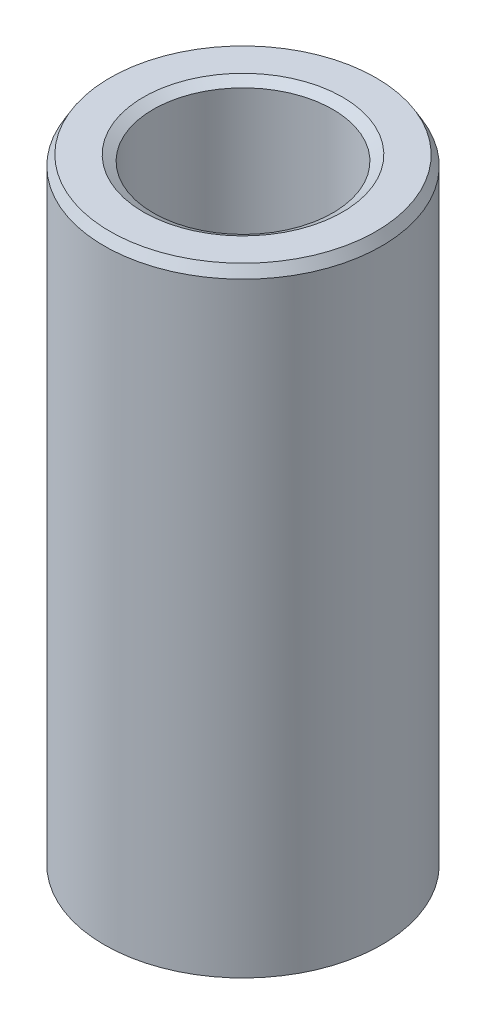
ISO-10303-21;
HEADER;
FILE_DESCRIPTION(('STEP AP214'),'2;1');
FILE_NAME('part.step','',(''),(''),'','','');
FILE_SCHEMA(('AUTOMOTIVE_DESIGN { 1 0 10303 214 1 1 1 1 }'));
ENDSEC;
DATA;
#1=APPLICATION_CONTEXT('core data for automotive mechanical design processes');
#2=APPLICATION_PROTOCOL_DEFINITION('international standard','automotive_design',2000,#1);
#3=PRODUCT_CONTEXT('',#1,'mechanical');
#4=PRODUCT('Part','Part','',(#3));
#5=PRODUCT_RELATED_PRODUCT_CATEGORY('part','',(#4));
#6=PRODUCT_DEFINITION_FORMATION('','',#4);
#7=PRODUCT_DEFINITION_CONTEXT('part definition',#1,'design');
#8=PRODUCT_DEFINITION('design','',#6,#7);
#9=PRODUCT_DEFINITION_SHAPE('','',#8);
#10=(LENGTH_UNIT() NAMED_UNIT(*) SI_UNIT(.MILLI.,.METRE.));
#11=(NAMED_UNIT(*) PLANE_ANGLE_UNIT() SI_UNIT($,.RADIAN.));
#12=(NAMED_UNIT(*) SI_UNIT($,.STERADIAN.) SOLID_ANGLE_UNIT());
#13=UNCERTAINTY_MEASURE_WITH_UNIT(LENGTH_MEASURE(1.E-05),#10,'distance_accuracy_value','');
#14=(GEOMETRIC_REPRESENTATION_CONTEXT(3) GLOBAL_UNCERTAINTY_ASSIGNED_CONTEXT((#13)) GLOBAL_UNIT_ASSIGNED_CONTEXT((#10,
#11,#12)) REPRESENTATION_CONTEXT('',''));
#15=CARTESIAN_POINT('',(0.,0.,0.));
#16=DIRECTION('',(0.,0.,1.));
#17=DIRECTION('',(1.,0.,0.));
#18=AXIS2_PLACEMENT_3D('',#15,#16,#17);
#19=CARTESIAN_POINT('',(0.,44.7324756518549,0.));
#20=DIRECTION('',(0.,-1.,0.));
#21=DIRECTION('',(0.,0.,-1.));
#22=AXIS2_PLACEMENT_3D('',#19,#20,#21);
#23=CYLINDRICAL_SURFACE('',#22,10.);
#24=CARTESIAN_POINT('',(0.,0.408844589447899,0.));
#25=DIRECTION('',(0.,1.,0.));
#26=DIRECTION('',(0.,0.,1.));
#27=AXIS2_PLACEMENT_3D('',#24,#25,#26);
#28=CIRCLE('',#27,10.);
#29=CARTESIAN_POINT('',(0.,0.408844589447899,10.));
#30=VERTEX_POINT('',#29);
#31=EDGE_CURVE('E10',#30,#30,#28,.T.);
#32=ORIENTED_EDGE('',*,*,#31,.T.);
#33=EDGE_LOOP('',(#32));
#34=FACE_BOUND('',#33,.T.);
#35=CARTESIAN_POINT('',(0.,44.0243360505315,0.));
#36=DIRECTION('',(0.,1.,0.));
#37=DIRECTION('',(0.,0.,1.));
#38=AXIS2_PLACEMENT_3D('',#35,#36,#37);
#39=CIRCLE('',#38,10.);
#40=CARTESIAN_POINT('',(0.,44.0243360505315,-10.));
#41=VERTEX_POINT('',#40);
#42=EDGE_CURVE('E50',#41,#41,#39,.F.);
#43=ORIENTED_EDGE('',*,*,#42,.T.);
#44=EDGE_LOOP('',(#43));
#45=FACE_BOUND('',#44,.T.);
#46=ADVANCED_FACE('F39',(#34,#45),#23,.T.);
#47=CARTESIAN_POINT('',(0.,44.7324756518549,0.));
#48=DIRECTION('',(0.,1.,0.));
#49=DIRECTION('',(0.,0.,1.));
#50=AXIS2_PLACEMENT_3D('',#47,#48,#49);
#51=PLANE('',#50);
#52=CARTESIAN_POINT('',(0.,44.7324756518549,0.));
#53=DIRECTION('',(0.,1.,0.));
#54=DIRECTION('',(0.,0.,1.));
#55=AXIS2_PLACEMENT_3D('',#52,#53,#54);
#56=CIRCLE('',#55,7.17815464745107);
#57=CARTESIAN_POINT('',(0.,44.7324756518549,7.17815464745107));
#58=VERTEX_POINT('',#57);
#59=EDGE_CURVE('E58',#58,#58,#56,.F.);
#60=ORIENTED_EDGE('',*,*,#59,.T.);
#61=EDGE_LOOP('',(#60));
#62=FACE_BOUND('',#61,.T.);
#63=CARTESIAN_POINT('',(0.,44.7324756518549,0.));
#64=DIRECTION('',(0.,1.,0.));
#65=DIRECTION('',(0.,0.,1.));
#66=AXIS2_PLACEMENT_3D('',#63,#64,#65);
#67=CIRCLE('',#66,9.59115541055211);
#68=CARTESIAN_POINT('',(0.,44.7324756518549,-9.59115541055212));
#69=VERTEX_POINT('',#68);
#70=EDGE_CURVE('E61',#69,#69,#67,.T.);
#71=ORIENTED_EDGE('',*,*,#70,.T.);
#72=EDGE_LOOP('',(#71));
#73=FACE_BOUND('',#72,.T.);
#74=ADVANCED_FACE('F88',(#62,#73),#51,.T.);
#75=CARTESIAN_POINT('',(0.,0.,0.));
#76=DIRECTION('',(0.,1.,0.));
#77=DIRECTION('',(0.,0.,1.));
#78=AXIS2_PLACEMENT_3D('',#75,#76,#77);
#79=PLANE('',#78);
#80=CARTESIAN_POINT('',(0.,0.,0.));
#81=DIRECTION('',(0.,1.,0.));
#82=DIRECTION('',(0.,0.,1.));
#83=AXIS2_PLACEMENT_3D('',#80,#81,#82);
#84=CIRCLE('',#83,6.87885963557558);
#85=CARTESIAN_POINT('',(0.,0.,6.87885963557558));
#86=VERTEX_POINT('',#85);
#87=EDGE_CURVE('E51',#86,#86,#84,.T.);
#88=ORIENTED_EDGE('',*,*,#87,.T.);
#89=EDGE_LOOP('',(#88));
#90=FACE_BOUND('',#89,.T.);
#91=CARTESIAN_POINT('',(0.,0.,0.));
#92=DIRECTION('',(0.,1.,0.));
#93=DIRECTION('',(0.,0.,1.));
#94=AXIS2_PLACEMENT_3D('',#91,#92,#93);
#95=CIRCLE('',#94,9.2918603986766);
#96=CARTESIAN_POINT('',(0.,0.,9.2918603986766));
#97=VERTEX_POINT('',#96);
#98=EDGE_CURVE('E54',#97,#97,#95,.F.);
#99=ORIENTED_EDGE('',*,*,#98,.T.);
#100=EDGE_LOOP('',(#99));
#101=FACE_BOUND('',#100,.T.);
#102=ADVANCED_FACE('F83',(#90,#101),#79,.F.);
#103=CARTESIAN_POINT('',(0.,44.7324756518549,0.));
#104=DIRECTION('',(0.,-1.,0.));
#105=DIRECTION('',(0.,0.,-1.));
#106=AXIS2_PLACEMENT_3D('',#103,#104,#105);
#107=CYLINDRICAL_SURFACE('',#106,6.47001504612768);
#108=CARTESIAN_POINT('',(0.,44.323631062407,0.));
#109=DIRECTION('',(0.,1.,0.));
#110=DIRECTION('',(0.,0.,1.));
#111=AXIS2_PLACEMENT_3D('',#108,#109,#110);
#112=CIRCLE('',#111,6.47001504612768);
#113=CARTESIAN_POINT('',(0.,44.323631062407,6.47001504612768));
#114=VERTEX_POINT('',#113);
#115=EDGE_CURVE('E67',#114,#114,#112,.T.);
#116=ORIENTED_EDGE('',*,*,#115,.T.);
#117=EDGE_LOOP('',(#116));
#118=FACE_BOUND('',#117,.T.);
#119=CARTESIAN_POINT('',(0.,0.708139601323397,0.));
#120=DIRECTION('',(0.,1.,0.));
#121=DIRECTION('',(0.,0.,1.));
#122=AXIS2_PLACEMENT_3D('',#119,#120,#121);
#123=CIRCLE('',#122,6.47001504612768);
#124=CARTESIAN_POINT('',(0.,0.708139601323397,6.47001504612768));
#125=VERTEX_POINT('',#124);
#126=EDGE_CURVE('E69',#125,#125,#123,.F.);
#127=ORIENTED_EDGE('',*,*,#126,.T.);
#128=EDGE_LOOP('',(#127));
#129=FACE_BOUND('',#128,.T.);
#130=ADVANCED_FACE('F71',(#118,#129),#107,.F.);
#131=CARTESIAN_POINT('',(0.,44.323631062407,0.));
#132=DIRECTION('',(0.,1.,0.));
#133=DIRECTION('',(0.,0.,1.));
#134=AXIS2_PLACEMENT_3D('',#131,#132,#133);
#135=CONICAL_SURFACE('',#134,6.47001504612768,1.04719755119659);
#136=ORIENTED_EDGE('',*,*,#59,.F.);
#137=EDGE_LOOP('',(#136));
#138=FACE_BOUND('',#137,.T.);
#139=ORIENTED_EDGE('',*,*,#115,.F.);
#140=EDGE_LOOP('',(#139));
#141=FACE_BOUND('',#140,.T.);
#142=ADVANCED_FACE('F77',(#138,#141),#135,.F.);
#143=CARTESIAN_POINT('',(0.,0.,0.));
#144=DIRECTION('',(0.,-1.,0.));
#145=DIRECTION('',(0.,0.,-1.));
#146=AXIS2_PLACEMENT_3D('',#143,#144,#145);
#147=CONICAL_SURFACE('',#146,6.87885963557558,0.523598775598297);
#148=ORIENTED_EDGE('',*,*,#126,.F.);
#149=EDGE_LOOP('',(#148));
#150=FACE_BOUND('',#149,.T.);
#151=ORIENTED_EDGE('',*,*,#87,.F.);
#152=EDGE_LOOP('',(#151));
#153=FACE_BOUND('',#152,.T.);
#154=ADVANCED_FACE('F73',(#150,#153),#147,.F.);
#155=CARTESIAN_POINT('',(0.,0.408844589447899,0.));
#156=DIRECTION('',(0.,1.,0.));
#157=DIRECTION('',(0.,0.,1.));
#158=AXIS2_PLACEMENT_3D('',#155,#156,#157);
#159=CONICAL_SURFACE('',#158,10.,1.0471975511966);
#160=ORIENTED_EDGE('',*,*,#98,.F.);
#161=EDGE_LOOP('',(#160));
#162=FACE_BOUND('',#161,.T.);
#163=ORIENTED_EDGE('',*,*,#31,.F.);
#164=EDGE_LOOP('',(#163));
#165=FACE_BOUND('',#164,.T.);
#166=ADVANCED_FACE('F76',(#162,#165),#159,.T.);
#167=CARTESIAN_POINT('',(0.,44.7324756518549,0.));
#168=DIRECTION('',(0.,-1.,0.));
#169=DIRECTION('',(0.,0.,-1.));
#170=AXIS2_PLACEMENT_3D('',#167,#168,#169);
#171=CONICAL_SURFACE('',#170,9.59115541055211,0.523598775598293);
#172=CARTESIAN_POINT('',(0.,44.0243360505315,-10.));
#173=CARTESIAN_POINT('',(0.,44.0317125047119,-9.99574120219325));
#174=CARTESIAN_POINT('',(0.,44.0390889588924,-9.9914824043865));
#175=CARTESIAN_POINT('',(0.,44.0538418672533,-9.98296480877301));
#176=CARTESIAN_POINT('',(0.,44.0612183214337,-9.97870601096626));
#177=CARTESIAN_POINT('',(0.,44.0759712297946,-9.97018841535276));
#178=CARTESIAN_POINT('',(0.,44.0833476839751,-9.96592961754601));
#179=CARTESIAN_POINT('',(0.,44.098100592336,-9.95741202193252));
#180=CARTESIAN_POINT('',(0.,44.1054770465165,-9.95315322412577));
#181=CARTESIAN_POINT('',(0.,44.1202299548774,-9.94463562851227));
#182=CARTESIAN_POINT('',(0.,44.1276064090578,-9.94037683070552));
#183=CARTESIAN_POINT('',(0.,44.1423593174187,-9.93185923509202));
#184=CARTESIAN_POINT('',(0.,44.1497357715992,-9.92760043728527));
#185=CARTESIAN_POINT('',(0.,44.1644886799601,-9.91908284167178));
#186=CARTESIAN_POINT('',(0.,44.1718651341405,-9.91482404386503));
#187=CARTESIAN_POINT('',(0.,44.1866180425014,-9.90630644825153));
#188=CARTESIAN_POINT('',(0.,44.1939944966819,-9.90204765044478));
#189=CARTESIAN_POINT('',(0.,44.2087474050428,-9.89353005483128));
#190=CARTESIAN_POINT('',(0.,44.2161238592232,-9.88927125702453));
#191=CARTESIAN_POINT('',(0.,44.2308767675841,-9.88075366141104));
#192=CARTESIAN_POINT('',(0.,44.2382532217646,-9.87649486360429));
#193=CARTESIAN_POINT('',(0.,44.2530061301255,-9.86797726799079));
#194=CARTESIAN_POINT('',(0.,44.2603825843059,-9.86371847018404));
#195=CARTESIAN_POINT('',(0.,44.2751354926669,-9.85520087457054));
#196=CARTESIAN_POINT('',(0.,44.2825119468473,-9.85094207676379));
#197=CARTESIAN_POINT('',(0.,44.2972648552082,-9.8424244811503));
#198=CARTESIAN_POINT('',(0.,44.3046413093887,-9.83816568334355));
#199=CARTESIAN_POINT('',(0.,44.3193942177496,-9.82964808773005));
#200=CARTESIAN_POINT('',(0.,44.32677067193,-9.8253892899233));
#201=CARTESIAN_POINT('',(0.,44.3415235802909,-9.8168716943098));
#202=CARTESIAN_POINT('',(0.,44.3489000344714,-9.81261289650305));
#203=CARTESIAN_POINT('',(0.,44.3636529428323,-9.80409530088956));
#204=CARTESIAN_POINT('',(0.,44.3710293970127,-9.79983650308281));
#205=CARTESIAN_POINT('',(0.,44.3857823053736,-9.79131890746931));
#206=CARTESIAN_POINT('',(0.,44.3931587595541,-9.78706010966256));
#207=CARTESIAN_POINT('',(0.,44.407911667915,-9.77854251404906));
#208=CARTESIAN_POINT('',(0.,44.4152881220954,-9.77428371624232));
#209=CARTESIAN_POINT('',(0.,44.4300410304563,-9.76576612062882));
#210=CARTESIAN_POINT('',(0.,44.4374174846368,-9.76150732282207));
#211=CARTESIAN_POINT('',(0.,44.4521703929977,-9.75298972720857));
#212=CARTESIAN_POINT('',(0.,44.4595468471782,-9.74873092940182));
#213=CARTESIAN_POINT('',(0.,44.4742997555391,-9.74021333378833));
#214=CARTESIAN_POINT('',(0.,44.4816762097195,-9.73595453598158));
#215=CARTESIAN_POINT('',(0.,44.4964291180804,-9.72743694036808));
#216=CARTESIAN_POINT('',(0.,44.5038055722609,-9.72317814256133));
#217=CARTESIAN_POINT('',(0.,44.5185584806218,-9.71466054694783));
#218=CARTESIAN_POINT('',(0.,44.5259349348022,-9.71040174914108));
#219=CARTESIAN_POINT('',(0.,44.5406878431631,-9.70188415352759));
#220=CARTESIAN_POINT('',(0.,44.5480642973436,-9.69762535572084));
#221=CARTESIAN_POINT('',(0.,44.5628172057045,-9.68910776010734));
#222=CARTESIAN_POINT('',(0.,44.5701936598849,-9.68484896230059));
#223=CARTESIAN_POINT('',(0.,44.5849465682458,-9.67633136668709));
#224=CARTESIAN_POINT('',(0.,44.5923230224263,-9.67207256888034));
#225=CARTESIAN_POINT('',(0.,44.6070759307872,-9.66355497326685));
#226=CARTESIAN_POINT('',(0.,44.6144523849676,-9.6592961754601));
#227=CARTESIAN_POINT('',(0.,44.6292052933285,-9.6507785798466));
#228=CARTESIAN_POINT('',(0.,44.636581747509,-9.64651978203985));
#229=CARTESIAN_POINT('',(0.,44.6513346558699,-9.63800218642635));
#230=CARTESIAN_POINT('',(0.,44.6587111100504,-9.6337433886196));
#231=CARTESIAN_POINT('',(0.,44.6734640184113,-9.62522579300611));
#232=CARTESIAN_POINT('',(0.,44.6808404725917,-9.62096699519936));
#233=CARTESIAN_POINT('',(0.,44.6955933809526,-9.61244939958586));
#234=CARTESIAN_POINT('',(0.,44.7029698351331,-9.60819060177911));
#235=CARTESIAN_POINT('',(0.,44.717722743494,-9.59967300616561));
#236=CARTESIAN_POINT('',(0.,44.7250991976744,-9.59541420835886));
#237=CARTESIAN_POINT('',(0.,44.7324756518549,-9.59115541055212));
#238=B_SPLINE_CURVE_WITH_KNOTS('',3,(#172,#173,#174,#175,#176,#177,#178,#179,#180,#181,#182,
#183,#184,#185,#186,#187,#188,#189,#190,#191,#192,#193,#194,#195,#196,#197,#198,#199,#200,#201,
#202,#203,#204,#205,#206,#207,#208,#209,#210,#211,#212,#213,#214,#215,#216,#217,#218,#219,#220,
#221,#222,#223,#224,#225,#226,#227,#228,#229,#230,#231,#232,#233,#234,#235,#236,#237),
.UNSPECIFIED.,.F.,.F.,(4,2,2,2,2,2,2,2,2,2,2,2,2,2,2,2,2,2,2,2,2,2,2,2,2,2,2,2,2,2,2,2,4),(0.,
0.0255527868404916,0.0511055736809822,0.0766583605214738,0.102211147361971,0.127763934202463,
0.153316721042954,0.178869507883452,0.204422294723943,0.229975081564434,0.255527868404932,
0.281080655245423,0.306633442085915,0.332186228926412,0.357739015766903,0.383291802607395,
0.408844589447892,0.434397376288384,0.459950163128875,0.485502949969366,0.511055736809864,
0.536608523650355,0.562161310490847,0.587714097331344,0.613266884171835,0.638819671012327,
0.664372457852824,0.689925244693316,0.715478031533808,0.741030818374304,0.766583605214796,
0.792136392055288,0.817689178895785),.UNSPECIFIED.);
#239=EDGE_CURVE('BSEAM45',#41,#69,#238,.T.);
#240=ORIENTED_EDGE('',*,*,#42,.F.);
#241=ORIENTED_EDGE('',*,*,#70,.F.);
#242=ORIENTED_EDGE('',*,*,#239,.T.);
#243=ORIENTED_EDGE('',*,*,#239,.F.);
#244=EDGE_LOOP('',(#240,#242,#241,#243));
#245=FACE_BOUND('',#244,.T.);
#246=ADVANCED_FACE('F45',(#245),#171,.T.);
#247=CLOSED_SHELL('',(#46,#74,#102,#130,#142,#154,#166,#246));
#248=MANIFOLD_SOLID_BREP('B2',#247);
#249=ADVANCED_BREP_SHAPE_REPRESENTATION('',(#18,#248),#14);
#250=SHAPE_DEFINITION_REPRESENTATION(#9,#249);
ENDSEC;
END-ISO-10303-21;
